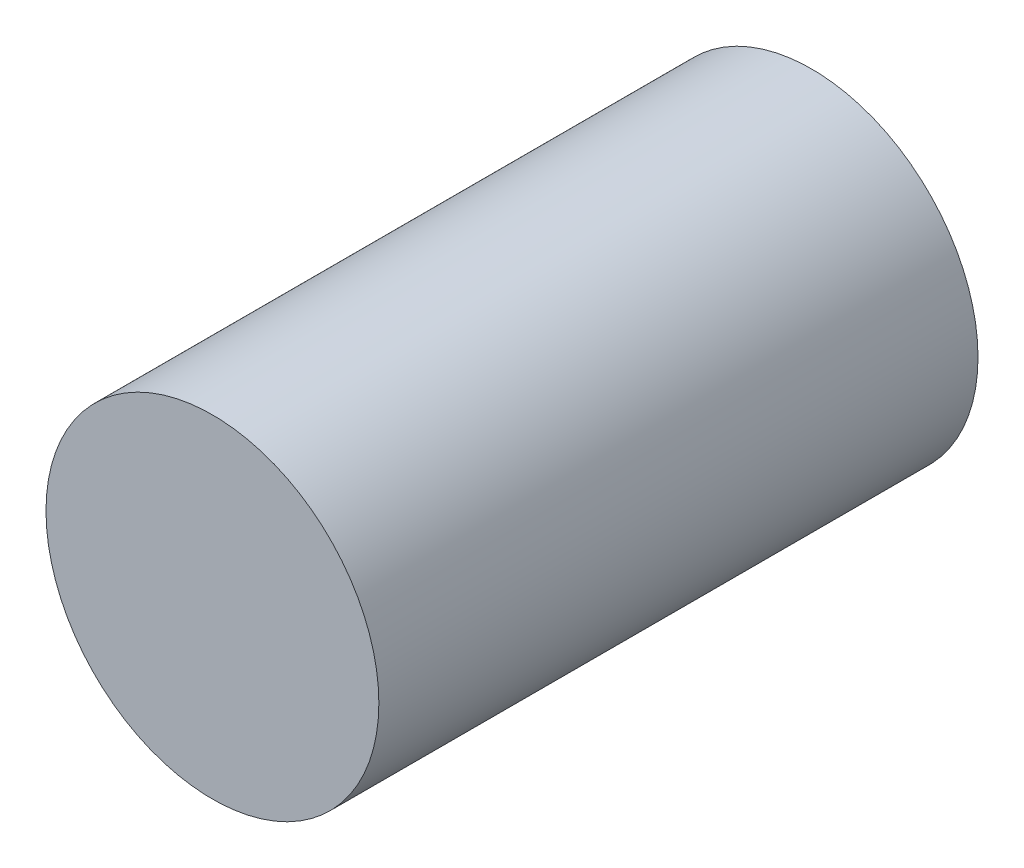
ISO-10303-21;
HEADER;
FILE_DESCRIPTION(('STEP AP214'),'2;1');
FILE_NAME('part.step','',(''),(''),'','','');
FILE_SCHEMA(('AUTOMOTIVE_DESIGN { 1 0 10303 214 1 1 1 1 }'));
ENDSEC;
DATA;
#1=APPLICATION_CONTEXT('core data for automotive mechanical design processes');
#2=APPLICATION_PROTOCOL_DEFINITION('international standard','automotive_design',2000,#1);
#3=PRODUCT_CONTEXT('',#1,'mechanical');
#4=PRODUCT('Part','Part','',(#3));
#5=PRODUCT_RELATED_PRODUCT_CATEGORY('part','',(#4));
#6=PRODUCT_DEFINITION_FORMATION('','',#4);
#7=PRODUCT_DEFINITION_CONTEXT('part definition',#1,'design');
#8=PRODUCT_DEFINITION('design','',#6,#7);
#9=PRODUCT_DEFINITION_SHAPE('','',#8);
#10=(LENGTH_UNIT() NAMED_UNIT(*) SI_UNIT(.MILLI.,.METRE.));
#11=(NAMED_UNIT(*) PLANE_ANGLE_UNIT() SI_UNIT($,.RADIAN.));
#12=(NAMED_UNIT(*) SI_UNIT($,.STERADIAN.) SOLID_ANGLE_UNIT());
#13=UNCERTAINTY_MEASURE_WITH_UNIT(LENGTH_MEASURE(1.E-05),#10,'distance_accuracy_value','');
#14=(GEOMETRIC_REPRESENTATION_CONTEXT(3) GLOBAL_UNCERTAINTY_ASSIGNED_CONTEXT((#13)) GLOBAL_UNIT_ASSIGNED_CONTEXT((#10,
#11,#12)) REPRESENTATION_CONTEXT('',''));
#15=CARTESIAN_POINT('',(0.,0.,0.));
#16=DIRECTION('',(0.,0.,1.));
#17=DIRECTION('',(1.,0.,0.));
#18=AXIS2_PLACEMENT_3D('',#15,#16,#17);
#19=CARTESIAN_POINT('',(0.,0.,18.));
#20=DIRECTION('',(0.,0.,-1.));
#21=DIRECTION('',(-1.,0.,0.));
#22=AXIS2_PLACEMENT_3D('',#19,#20,#21);
#23=CYLINDRICAL_SURFACE('',#22,5.);
#24=CARTESIAN_POINT('',(0.,0.,18.));
#25=DIRECTION('',(0.,0.,1.));
#26=DIRECTION('',(1.,0.,0.));
#27=AXIS2_PLACEMENT_3D('',#24,#25,#26);
#28=CIRCLE('',#27,5.);
#29=CARTESIAN_POINT('',(5.,0.,18.));
#30=VERTEX_POINT('',#29);
#31=EDGE_CURVE('E10',#30,#30,#28,.T.);
#32=ORIENTED_EDGE('',*,*,#31,.F.);
#33=EDGE_LOOP('',(#32));
#34=FACE_BOUND('',#33,.T.);
#35=CARTESIAN_POINT('',(0.,0.,0.));
#36=DIRECTION('',(0.,0.,1.));
#37=DIRECTION('',(1.,0.,0.));
#38=AXIS2_PLACEMENT_3D('',#35,#36,#37);
#39=CIRCLE('',#38,5.);
#40=CARTESIAN_POINT('',(5.,0.,0.));
#41=VERTEX_POINT('',#40);
#42=EDGE_CURVE('E40',#41,#41,#39,.T.);
#43=ORIENTED_EDGE('',*,*,#42,.T.);
#44=EDGE_LOOP('',(#43));
#45=FACE_BOUND('',#44,.T.);
#46=ADVANCED_FACE('F37',(#34,#45),#23,.T.);
#47=CARTESIAN_POINT('',(0.,0.,18.));
#48=DIRECTION('',(0.,0.,1.));
#49=DIRECTION('',(1.,0.,0.));
#50=AXIS2_PLACEMENT_3D('',#47,#48,#49);
#51=PLANE('',#50);
#52=ORIENTED_EDGE('',*,*,#31,.T.);
#53=EDGE_LOOP('',(#52));
#54=FACE_BOUND('',#53,.T.);
#55=ADVANCED_FACE('F54',(#54),#51,.T.);
#56=CARTESIAN_POINT('',(0.,0.,0.));
#57=DIRECTION('',(0.,0.,1.));
#58=DIRECTION('',(1.,0.,0.));
#59=AXIS2_PLACEMENT_3D('',#56,#57,#58);
#60=PLANE('',#59);
#61=ORIENTED_EDGE('',*,*,#42,.F.);
#62=EDGE_LOOP('',(#61));
#63=FACE_BOUND('',#62,.T.);
#64=ADVANCED_FACE('F52',(#63),#60,.F.);
#65=CLOSED_SHELL('',(#46,#55,#64));
#66=MANIFOLD_SOLID_BREP('B2',#65);
#67=ADVANCED_BREP_SHAPE_REPRESENTATION('',(#18,#66),#14);
#68=SHAPE_DEFINITION_REPRESENTATION(#9,#67);
ENDSEC;
END-ISO-10303-21;
